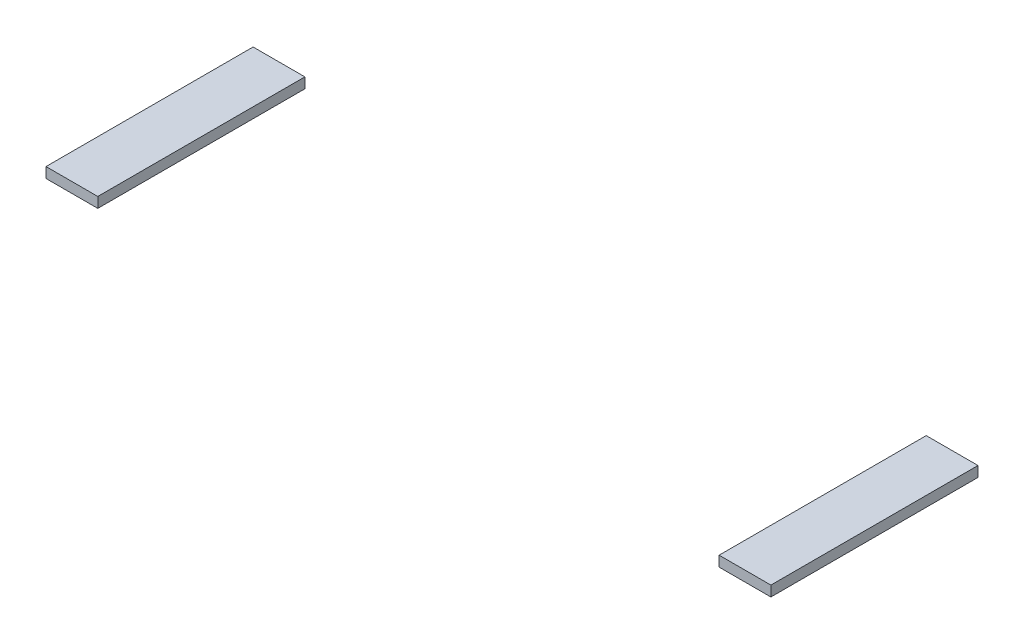
ISO-10303-21;
HEADER;
FILE_DESCRIPTION(('STEP AP214'),'2;1');
FILE_NAME('part.step','',(''),(''),'','','');
FILE_SCHEMA(('AUTOMOTIVE_DESIGN { 1 0 10303 214 1 1 1 1 }'));
ENDSEC;
DATA;
#1=APPLICATION_CONTEXT('core data for automotive mechanical design processes');
#2=APPLICATION_PROTOCOL_DEFINITION('international standard','automotive_design',2000,#1);
#3=PRODUCT_CONTEXT('',#1,'mechanical');
#4=PRODUCT('Part','Part','',(#3));
#5=PRODUCT_RELATED_PRODUCT_CATEGORY('part','',(#4));
#6=PRODUCT_DEFINITION_FORMATION('','',#4);
#7=PRODUCT_DEFINITION_CONTEXT('part definition',#1,'design');
#8=PRODUCT_DEFINITION('design','',#6,#7);
#9=PRODUCT_DEFINITION_SHAPE('','',#8);
#10=(LENGTH_UNIT() NAMED_UNIT(*) SI_UNIT(.MILLI.,.METRE.));
#11=(NAMED_UNIT(*) PLANE_ANGLE_UNIT() SI_UNIT($,.RADIAN.));
#12=(NAMED_UNIT(*) SI_UNIT($,.STERADIAN.) SOLID_ANGLE_UNIT());
#13=UNCERTAINTY_MEASURE_WITH_UNIT(LENGTH_MEASURE(1.E-05),#10,'distance_accuracy_value','');
#14=(GEOMETRIC_REPRESENTATION_CONTEXT(3) GLOBAL_UNCERTAINTY_ASSIGNED_CONTEXT((#13)) GLOBAL_UNIT_ASSIGNED_CONTEXT((#10,
#11,#12)) REPRESENTATION_CONTEXT('',''));
#15=CARTESIAN_POINT('',(0.,0.,0.));
#16=DIRECTION('',(0.,0.,1.));
#17=DIRECTION('',(1.,0.,0.));
#18=AXIS2_PLACEMENT_3D('',#15,#16,#17);
#19=CARTESIAN_POINT('',(26.,0.399999999999999,8.));
#20=DIRECTION('',(1.,0.,0.));
#21=DIRECTION('',(0.,0.,-1.));
#22=AXIS2_PLACEMENT_3D('',#19,#20,#21);
#23=PLANE('',#22);
#24=DIRECTION('',(0.,-1.,0.));
#25=VECTOR('',#24,1.);
#26=CARTESIAN_POINT('',(26.,0.399999999999999,0.));
#27=LINE('',#26,#25);
#28=CARTESIAN_POINT('',(26.,0.399999999999999,0.));
#29=VERTEX_POINT('',#28);
#30=CARTESIAN_POINT('',(26.,0.,0.));
#31=VERTEX_POINT('',#30);
#32=EDGE_CURVE('E112',#29,#31,#27,.T.);
#33=ORIENTED_EDGE('',*,*,#32,.T.);
#34=DIRECTION('',(0.,0.,-1.));
#35=VECTOR('',#34,1.);
#36=CARTESIAN_POINT('',(26.,0.,8.));
#37=LINE('',#36,#35);
#38=CARTESIAN_POINT('',(26.,0.,8.));
#39=VERTEX_POINT('',#38);
#40=EDGE_CURVE('E12',#39,#31,#37,.T.);
#41=ORIENTED_EDGE('',*,*,#40,.F.);
#42=DIRECTION('',(0.,-1.,0.));
#43=VECTOR('',#42,1.);
#44=CARTESIAN_POINT('',(26.,0.399999999999999,8.));
#45=LINE('',#44,#43);
#46=CARTESIAN_POINT('',(26.,0.399999999999999,8.));
#47=VERTEX_POINT('',#46);
#48=EDGE_CURVE('E100',#47,#39,#45,.T.);
#49=ORIENTED_EDGE('',*,*,#48,.F.);
#50=DIRECTION('',(0.,0.,-1.));
#51=VECTOR('',#50,1.);
#52=CARTESIAN_POINT('',(26.,0.399999999999999,8.));
#53=LINE('',#52,#51);
#54=EDGE_CURVE('E108',#47,#29,#53,.T.);
#55=ORIENTED_EDGE('',*,*,#54,.T.);
#56=EDGE_LOOP('',(#33,#41,#49,#55));
#57=FACE_BOUND('',#56,.T.);
#58=ADVANCED_FACE('F49',(#57),#23,.F.);
#59=CARTESIAN_POINT('',(26.,0.,8.));
#60=DIRECTION('',(0.,1.,0.));
#61=DIRECTION('',(0.,0.,1.));
#62=AXIS2_PLACEMENT_3D('',#59,#60,#61);
#63=PLANE('',#62);
#64=DIRECTION('',(1.,0.,0.));
#65=VECTOR('',#64,1.);
#66=CARTESIAN_POINT('',(26.,0.,0.));
#67=LINE('',#66,#65);
#68=CARTESIAN_POINT('',(28.,0.,0.));
#69=VERTEX_POINT('',#68);
#70=EDGE_CURVE('E104',#31,#69,#67,.T.);
#71=ORIENTED_EDGE('',*,*,#70,.T.);
#72=DIRECTION('',(0.,0.,-1.));
#73=VECTOR('',#72,1.);
#74=CARTESIAN_POINT('',(28.,0.,8.));
#75=LINE('',#74,#73);
#76=CARTESIAN_POINT('',(28.,0.,8.));
#77=VERTEX_POINT('',#76);
#78=EDGE_CURVE('E57',#77,#69,#75,.T.);
#79=ORIENTED_EDGE('',*,*,#78,.F.);
#80=DIRECTION('',(1.,0.,0.));
#81=VECTOR('',#80,1.);
#82=CARTESIAN_POINT('',(26.,0.,8.));
#83=LINE('',#82,#81);
#84=EDGE_CURVE('E95',#39,#77,#83,.T.);
#85=ORIENTED_EDGE('',*,*,#84,.F.);
#86=ORIENTED_EDGE('',*,*,#40,.T.);
#87=EDGE_LOOP('',(#71,#79,#85,#86));
#88=FACE_BOUND('',#87,.T.);
#89=ADVANCED_FACE('F103',(#88),#63,.F.);
#90=CARTESIAN_POINT('',(28.,0.4,8.));
#91=DIRECTION('',(-1.,0.,0.));
#92=DIRECTION('',(0.,0.,1.));
#93=AXIS2_PLACEMENT_3D('',#90,#91,#92);
#94=PLANE('',#93);
#95=DIRECTION('',(0.,1.,0.));
#96=VECTOR('',#95,1.);
#97=CARTESIAN_POINT('',(28.,0.4,0.));
#98=LINE('',#97,#96);
#99=CARTESIAN_POINT('',(28.,0.4,0.));
#100=VERTEX_POINT('',#99);
#101=EDGE_CURVE('E82',#69,#100,#98,.T.);
#102=ORIENTED_EDGE('',*,*,#101,.T.);
#103=DIRECTION('',(0.,0.,-1.));
#104=VECTOR('',#103,1.);
#105=CARTESIAN_POINT('',(28.,0.4,8.));
#106=LINE('',#105,#104);
#107=CARTESIAN_POINT('',(28.,0.4,8.));
#108=VERTEX_POINT('',#107);
#109=EDGE_CURVE('E105',#108,#100,#106,.T.);
#110=ORIENTED_EDGE('',*,*,#109,.F.);
#111=DIRECTION('',(0.,1.,0.));
#112=VECTOR('',#111,1.);
#113=CARTESIAN_POINT('',(28.,0.4,8.));
#114=LINE('',#113,#112);
#115=EDGE_CURVE('E98',#77,#108,#114,.T.);
#116=ORIENTED_EDGE('',*,*,#115,.F.);
#117=ORIENTED_EDGE('',*,*,#78,.T.);
#118=EDGE_LOOP('',(#102,#110,#116,#117));
#119=FACE_BOUND('',#118,.T.);
#120=ADVANCED_FACE('F106',(#119),#94,.F.);
#121=CARTESIAN_POINT('',(26.,0.399999999999999,8.));
#122=DIRECTION('',(0.,-1.,0.));
#123=DIRECTION('',(1.,0.,0.));
#124=AXIS2_PLACEMENT_3D('',#121,#122,#123);
#125=PLANE('',#124);
#126=DIRECTION('',(-1.,0.,0.));
#127=VECTOR('',#126,1.);
#128=CARTESIAN_POINT('',(26.,0.399999999999999,0.));
#129=LINE('',#128,#127);
#130=EDGE_CURVE('E88',#100,#29,#129,.T.);
#131=ORIENTED_EDGE('',*,*,#130,.T.);
#132=ORIENTED_EDGE('',*,*,#54,.F.);
#133=DIRECTION('',(-1.,0.,0.));
#134=VECTOR('',#133,1.);
#135=CARTESIAN_POINT('',(26.,0.399999999999999,8.));
#136=LINE('',#135,#134);
#137=EDGE_CURVE('E65',#108,#47,#136,.T.);
#138=ORIENTED_EDGE('',*,*,#137,.F.);
#139=ORIENTED_EDGE('',*,*,#109,.T.);
#140=EDGE_LOOP('',(#131,#132,#138,#139));
#141=FACE_BOUND('',#140,.T.);
#142=ADVANCED_FACE('F119',(#141),#125,.F.);
#143=CARTESIAN_POINT('',(0.,0.,8.));
#144=DIRECTION('',(0.,0.,1.));
#145=DIRECTION('',(1.,0.,0.));
#146=AXIS2_PLACEMENT_3D('',#143,#144,#145);
#147=PLANE('',#146);
#148=ORIENTED_EDGE('',*,*,#48,.T.);
#149=ORIENTED_EDGE('',*,*,#84,.T.);
#150=ORIENTED_EDGE('',*,*,#115,.T.);
#151=ORIENTED_EDGE('',*,*,#137,.T.);
#152=EDGE_LOOP('',(#148,#149,#150,#151));
#153=FACE_BOUND('',#152,.T.);
#154=ADVANCED_FACE('F96',(#153),#147,.T.);
#155=CARTESIAN_POINT('',(0.,0.,0.));
#156=DIRECTION('',(0.,0.,1.));
#157=DIRECTION('',(1.,0.,0.));
#158=AXIS2_PLACEMENT_3D('',#155,#156,#157);
#159=PLANE('',#158);
#160=ORIENTED_EDGE('',*,*,#32,.F.);
#161=ORIENTED_EDGE('',*,*,#130,.F.);
#162=ORIENTED_EDGE('',*,*,#101,.F.);
#163=ORIENTED_EDGE('',*,*,#70,.F.);
#164=EDGE_LOOP('',(#160,#161,#162,#163));
#165=FACE_BOUND('',#164,.T.);
#166=ADVANCED_FACE('F122',(#165),#159,.F.);
#167=CLOSED_SHELL('',(#58,#89,#120,#142,#154,#166));
#168=MANIFOLD_SOLID_BREP('B2',#167);
#169=CARTESIAN_POINT('',(0.,0.,8.));
#170=DIRECTION('',(1.,0.,0.));
#171=DIRECTION('',(0.,0.,-1.));
#172=AXIS2_PLACEMENT_3D('',#169,#170,#171);
#173=PLANE('',#172);
#174=DIRECTION('',(0.,-1.,0.));
#175=VECTOR('',#174,1.);
#176=CARTESIAN_POINT('',(0.,0.,0.));
#177=LINE('',#176,#175);
#178=CARTESIAN_POINT('',(0.,0.4,0.));
#179=VERTEX_POINT('',#178);
#180=CARTESIAN_POINT('',(0.,0.,0.));
#181=VERTEX_POINT('',#180);
#182=EDGE_CURVE('E236',#179,#181,#177,.T.);
#183=ORIENTED_EDGE('',*,*,#182,.T.);
#184=DIRECTION('',(0.,0.,-1.));
#185=VECTOR('',#184,1.);
#186=CARTESIAN_POINT('',(0.,0.,8.));
#187=LINE('',#186,#185);
#188=CARTESIAN_POINT('',(0.,0.,8.));
#189=VERTEX_POINT('',#188);
#190=EDGE_CURVE('E47',#189,#181,#187,.T.);
#191=ORIENTED_EDGE('',*,*,#190,.F.);
#192=DIRECTION('',(0.,-1.,0.));
#193=VECTOR('',#192,1.);
#194=CARTESIAN_POINT('',(0.,0.,8.));
#195=LINE('',#194,#193);
#196=CARTESIAN_POINT('',(0.,0.4,8.));
#197=VERTEX_POINT('',#196);
#198=EDGE_CURVE('E224',#197,#189,#195,.T.);
#199=ORIENTED_EDGE('',*,*,#198,.F.);
#200=DIRECTION('',(0.,0.,-1.));
#201=VECTOR('',#200,1.);
#202=CARTESIAN_POINT('',(0.,0.4,8.));
#203=LINE('',#202,#201);
#204=EDGE_CURVE('E232',#197,#179,#203,.T.);
#205=ORIENTED_EDGE('',*,*,#204,.T.);
#206=EDGE_LOOP('',(#183,#191,#199,#205));
#207=FACE_BOUND('',#206,.T.);
#208=ADVANCED_FACE('F173',(#207),#173,.F.);
#209=CARTESIAN_POINT('',(0.,0.,8.));
#210=DIRECTION('',(0.,1.,0.));
#211=DIRECTION('',(0.,0.,1.));
#212=AXIS2_PLACEMENT_3D('',#209,#210,#211);
#213=PLANE('',#212);
#214=DIRECTION('',(1.,0.,0.));
#215=VECTOR('',#214,1.);
#216=CARTESIAN_POINT('',(0.,0.,0.));
#217=LINE('',#216,#215);
#218=CARTESIAN_POINT('',(2.,0.,0.));
#219=VERTEX_POINT('',#218);
#220=EDGE_CURVE('E228',#181,#219,#217,.T.);
#221=ORIENTED_EDGE('',*,*,#220,.T.);
#222=DIRECTION('',(0.,0.,-1.));
#223=VECTOR('',#222,1.);
#224=CARTESIAN_POINT('',(2.,0.,8.));
#225=LINE('',#224,#223);
#226=CARTESIAN_POINT('',(2.,0.,8.));
#227=VERTEX_POINT('',#226);
#228=EDGE_CURVE('E181',#227,#219,#225,.T.);
#229=ORIENTED_EDGE('',*,*,#228,.F.);
#230=DIRECTION('',(1.,0.,0.));
#231=VECTOR('',#230,1.);
#232=CARTESIAN_POINT('',(0.,0.,8.));
#233=LINE('',#232,#231);
#234=EDGE_CURVE('E219',#189,#227,#233,.T.);
#235=ORIENTED_EDGE('',*,*,#234,.F.);
#236=ORIENTED_EDGE('',*,*,#190,.T.);
#237=EDGE_LOOP('',(#221,#229,#235,#236));
#238=FACE_BOUND('',#237,.T.);
#239=ADVANCED_FACE('F227',(#238),#213,.F.);
#240=CARTESIAN_POINT('',(2.,0.,8.));
#241=DIRECTION('',(-1.,0.,0.));
#242=DIRECTION('',(0.,0.,1.));
#243=AXIS2_PLACEMENT_3D('',#240,#241,#242);
#244=PLANE('',#243);
#245=DIRECTION('',(0.,1.,0.));
#246=VECTOR('',#245,1.);
#247=CARTESIAN_POINT('',(2.,0.,0.));
#248=LINE('',#247,#246);
#249=CARTESIAN_POINT('',(2.,0.4,0.));
#250=VERTEX_POINT('',#249);
#251=EDGE_CURVE('E206',#219,#250,#248,.T.);
#252=ORIENTED_EDGE('',*,*,#251,.T.);
#253=DIRECTION('',(0.,0.,-1.));
#254=VECTOR('',#253,1.);
#255=CARTESIAN_POINT('',(2.,0.4,8.));
#256=LINE('',#255,#254);
#257=CARTESIAN_POINT('',(2.,0.4,8.));
#258=VERTEX_POINT('',#257);
#259=EDGE_CURVE('E229',#258,#250,#256,.T.);
#260=ORIENTED_EDGE('',*,*,#259,.F.);
#261=DIRECTION('',(0.,1.,0.));
#262=VECTOR('',#261,1.);
#263=CARTESIAN_POINT('',(2.,0.,8.));
#264=LINE('',#263,#262);
#265=EDGE_CURVE('E222',#227,#258,#264,.T.);
#266=ORIENTED_EDGE('',*,*,#265,.F.);
#267=ORIENTED_EDGE('',*,*,#228,.T.);
#268=EDGE_LOOP('',(#252,#260,#266,#267));
#269=FACE_BOUND('',#268,.T.);
#270=ADVANCED_FACE('F230',(#269),#244,.F.);
#271=CARTESIAN_POINT('',(0.,0.4,8.));
#272=DIRECTION('',(0.,-1.,0.));
#273=DIRECTION('',(0.,0.,-1.));
#274=AXIS2_PLACEMENT_3D('',#271,#272,#273);
#275=PLANE('',#274);
#276=DIRECTION('',(-1.,0.,0.));
#277=VECTOR('',#276,1.);
#278=CARTESIAN_POINT('',(0.,0.4,0.));
#279=LINE('',#278,#277);
#280=EDGE_CURVE('E212',#250,#179,#279,.T.);
#281=ORIENTED_EDGE('',*,*,#280,.T.);
#282=ORIENTED_EDGE('',*,*,#204,.F.);
#283=DIRECTION('',(-1.,0.,0.));
#284=VECTOR('',#283,1.);
#285=CARTESIAN_POINT('',(0.,0.4,8.));
#286=LINE('',#285,#284);
#287=EDGE_CURVE('E189',#258,#197,#286,.T.);
#288=ORIENTED_EDGE('',*,*,#287,.F.);
#289=ORIENTED_EDGE('',*,*,#259,.T.);
#290=EDGE_LOOP('',(#281,#282,#288,#289));
#291=FACE_BOUND('',#290,.T.);
#292=ADVANCED_FACE('F243',(#291),#275,.F.);
#293=CARTESIAN_POINT('',(0.,0.,8.));
#294=DIRECTION('',(0.,0.,-1.));
#295=DIRECTION('',(-1.,0.,0.));
#296=AXIS2_PLACEMENT_3D('',#293,#294,#295);
#297=PLANE('',#296);
#298=ORIENTED_EDGE('',*,*,#198,.T.);
#299=ORIENTED_EDGE('',*,*,#234,.T.);
#300=ORIENTED_EDGE('',*,*,#265,.T.);
#301=ORIENTED_EDGE('',*,*,#287,.T.);
#302=EDGE_LOOP('',(#298,#299,#300,#301));
#303=FACE_BOUND('',#302,.T.);
#304=ADVANCED_FACE('F220',(#303),#297,.F.);
#305=CARTESIAN_POINT('',(0.,0.,0.));
#306=DIRECTION('',(0.,0.,-1.));
#307=DIRECTION('',(-1.,0.,0.));
#308=AXIS2_PLACEMENT_3D('',#305,#306,#307);
#309=PLANE('',#308);
#310=ORIENTED_EDGE('',*,*,#182,.F.);
#311=ORIENTED_EDGE('',*,*,#280,.F.);
#312=ORIENTED_EDGE('',*,*,#251,.F.);
#313=ORIENTED_EDGE('',*,*,#220,.F.);
#314=EDGE_LOOP('',(#310,#311,#312,#313));
#315=FACE_BOUND('',#314,.T.);
#316=ADVANCED_FACE('F246',(#315),#309,.T.);
#317=CLOSED_SHELL('',(#208,#239,#270,#292,#304,#316));
#318=MANIFOLD_SOLID_BREP('B6',#317);
#319=ADVANCED_BREP_SHAPE_REPRESENTATION('',(#18,#168,#318),#14);
#320=SHAPE_DEFINITION_REPRESENTATION(#9,#319);
ENDSEC;
END-ISO-10303-21;
